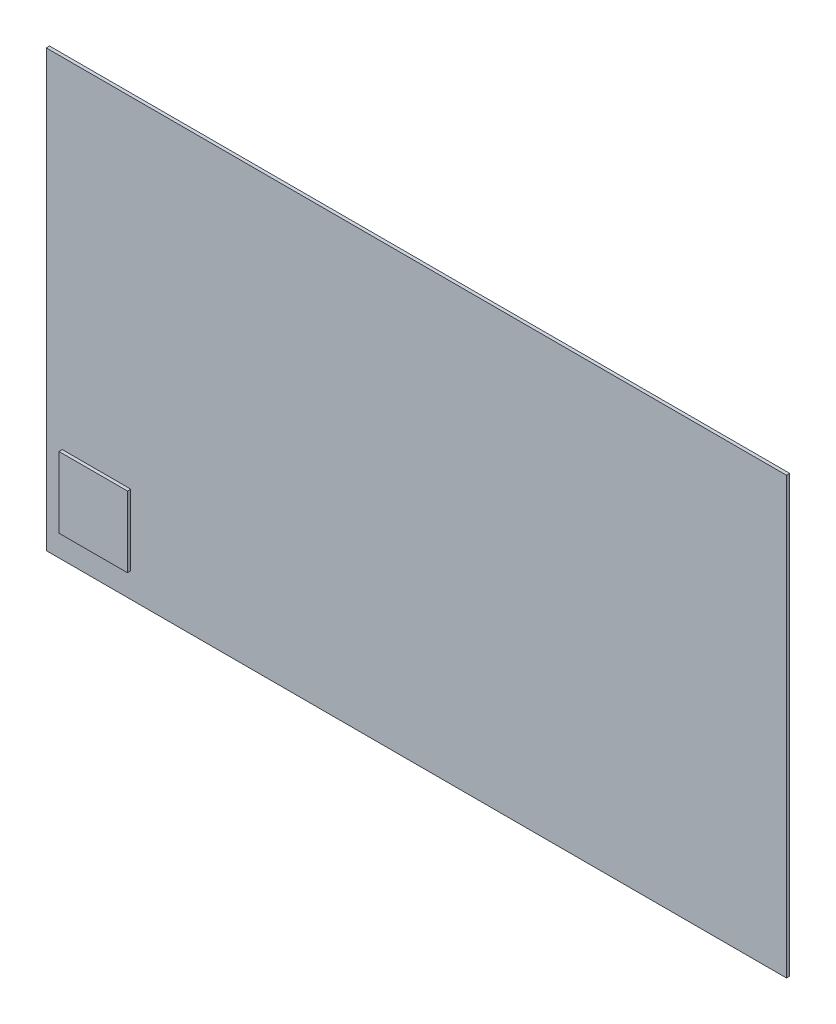
ISO-10303-21;
HEADER;
FILE_DESCRIPTION(('STEP AP214'),'2;1');
FILE_NAME('part.step','',(''),(''),'','','');
FILE_SCHEMA(('AUTOMOTIVE_DESIGN { 1 0 10303 214 1 1 1 1 }'));
ENDSEC;
DATA;
#1=APPLICATION_CONTEXT('core data for automotive mechanical design processes');
#2=APPLICATION_PROTOCOL_DEFINITION('international standard','automotive_design',2000,#1);
#3=PRODUCT_CONTEXT('',#1,'mechanical');
#4=PRODUCT('Part','Part','',(#3));
#5=PRODUCT_RELATED_PRODUCT_CATEGORY('part','',(#4));
#6=PRODUCT_DEFINITION_FORMATION('','',#4);
#7=PRODUCT_DEFINITION_CONTEXT('part definition',#1,'design');
#8=PRODUCT_DEFINITION('design','',#6,#7);
#9=PRODUCT_DEFINITION_SHAPE('','',#8);
#10=(LENGTH_UNIT() NAMED_UNIT(*) SI_UNIT(.MILLI.,.METRE.));
#11=(NAMED_UNIT(*) PLANE_ANGLE_UNIT() SI_UNIT($,.RADIAN.));
#12=(NAMED_UNIT(*) SI_UNIT($,.STERADIAN.) SOLID_ANGLE_UNIT());
#13=UNCERTAINTY_MEASURE_WITH_UNIT(LENGTH_MEASURE(1.E-05),#10,'distance_accuracy_value','');
#14=(GEOMETRIC_REPRESENTATION_CONTEXT(3) GLOBAL_UNCERTAINTY_ASSIGNED_CONTEXT((#13)) GLOBAL_UNIT_ASSIGNED_CONTEXT((#10,
#11,#12)) REPRESENTATION_CONTEXT('',''));
#15=CARTESIAN_POINT('',(0.,0.,0.));
#16=DIRECTION('',(0.,0.,1.));
#17=DIRECTION('',(1.,0.,0.));
#18=AXIS2_PLACEMENT_3D('',#15,#16,#17);
#19=CARTESIAN_POINT('',(0.,0.,0.381));
#20=DIRECTION('',(0.,0.,1.));
#21=DIRECTION('',(1.,0.,0.));
#22=AXIS2_PLACEMENT_3D('',#19,#20,#21);
#23=PLANE('',#22);
#24=DIRECTION('',(0.,1.,0.));
#25=VECTOR('',#24,1.);
#26=CARTESIAN_POINT('',(43.18,25.4,0.381));
#27=LINE('',#26,#25);
#28=CARTESIAN_POINT('',(43.18,-25.4,0.381));
#29=VERTEX_POINT('',#28);
#30=CARTESIAN_POINT('',(43.18,25.4,0.381));
#31=VERTEX_POINT('',#30);
#32=EDGE_CURVE('E140',#29,#31,#27,.T.);
#33=ORIENTED_EDGE('',*,*,#32,.T.);
#34=DIRECTION('',(-1.,0.,0.));
#35=VECTOR('',#34,1.);
#36=CARTESIAN_POINT('',(-43.18,25.4,0.381));
#37=LINE('',#36,#35);
#38=CARTESIAN_POINT('',(-43.18,25.4,0.381));
#39=VERTEX_POINT('',#38);
#40=EDGE_CURVE('E85',#31,#39,#37,.T.);
#41=ORIENTED_EDGE('',*,*,#40,.T.);
#42=DIRECTION('',(0.,-1.,0.));
#43=VECTOR('',#42,1.);
#44=CARTESIAN_POINT('',(-43.18,25.4,0.381));
#45=LINE('',#44,#43);
#46=CARTESIAN_POINT('',(-43.18,-25.4,0.381));
#47=VERTEX_POINT('',#46);
#48=EDGE_CURVE('E143',#39,#47,#45,.T.);
#49=ORIENTED_EDGE('',*,*,#48,.T.);
#50=DIRECTION('',(1.,0.,0.));
#51=VECTOR('',#50,1.);
#52=CARTESIAN_POINT('',(-43.18,-25.4,0.381));
#53=LINE('',#52,#51);
#54=EDGE_CURVE('E57',#47,#29,#53,.T.);
#55=ORIENTED_EDGE('',*,*,#54,.T.);
#56=EDGE_LOOP('',(#33,#41,#49,#55));
#57=FACE_BOUND('',#56,.T.);
#58=DIRECTION('',(-1.,0.,0.));
#59=VECTOR('',#58,1.);
#60=CARTESIAN_POINT('',(-41.318188726038,-14.2548154222372,0.381));
#61=LINE('',#60,#59);
#62=CARTESIAN_POINT('',(-33.3245849920017,-14.2548154222372,0.381));
#63=VERTEX_POINT('',#62);
#64=CARTESIAN_POINT('',(-41.318188726038,-14.2548154222372,0.381));
#65=VERTEX_POINT('',#64);
#66=EDGE_CURVE('E263',#63,#65,#61,.T.);
#67=ORIENTED_EDGE('',*,*,#66,.F.);
#68=DIRECTION('',(0.,1.,0.));
#69=VECTOR('',#68,1.);
#70=CARTESIAN_POINT('',(-33.3245849920017,-14.2548154222372,0.381));
#71=LINE('',#70,#69);
#72=CARTESIAN_POINT('',(-33.3245849920017,-22.5148726140748,0.381));
#73=VERTEX_POINT('',#72);
#74=EDGE_CURVE('E130',#73,#63,#71,.T.);
#75=ORIENTED_EDGE('',*,*,#74,.F.);
#76=DIRECTION('',(1.,0.,0.));
#77=VECTOR('',#76,1.);
#78=CARTESIAN_POINT('',(-41.318188726038,-22.5148726140748,0.381));
#79=LINE('',#78,#77);
#80=CARTESIAN_POINT('',(-41.318188726038,-22.5148726140748,0.381));
#81=VERTEX_POINT('',#80);
#82=EDGE_CURVE('E126',#81,#73,#79,.T.);
#83=ORIENTED_EDGE('',*,*,#82,.F.);
#84=DIRECTION('',(0.,-1.,0.));
#85=VECTOR('',#84,1.);
#86=CARTESIAN_POINT('',(-41.318188726038,-14.2548154222372,0.381));
#87=LINE('',#86,#85);
#88=EDGE_CURVE('E260',#65,#81,#87,.T.);
#89=ORIENTED_EDGE('',*,*,#88,.F.);
#90=EDGE_LOOP('',(#67,#75,#83,#89));
#91=FACE_BOUND('',#90,.T.);
#92=ADVANCED_FACE('F33',(#57,#91),#23,.T.);
#93=CARTESIAN_POINT('',(43.18,25.4,0.381));
#94=DIRECTION('',(-1.,0.,0.));
#95=DIRECTION('',(0.,-1.,0.));
#96=AXIS2_PLACEMENT_3D('',#93,#94,#95);
#97=PLANE('',#96);
#98=DIRECTION('',(0.,1.,0.));
#99=VECTOR('',#98,1.);
#100=CARTESIAN_POINT('',(43.18,25.4,0.));
#101=LINE('',#100,#99);
#102=CARTESIAN_POINT('',(43.18,-25.4,0.));
#103=VERTEX_POINT('',#102);
#104=CARTESIAN_POINT('',(43.18,25.4,0.));
#105=VERTEX_POINT('',#104);
#106=EDGE_CURVE('E132',#103,#105,#101,.T.);
#107=ORIENTED_EDGE('',*,*,#106,.T.);
#108=DIRECTION('',(0.,0.,-1.));
#109=VECTOR('',#108,1.);
#110=CARTESIAN_POINT('',(43.18,25.4,0.381));
#111=LINE('',#110,#109);
#112=EDGE_CURVE('E11',#31,#105,#111,.T.);
#113=ORIENTED_EDGE('',*,*,#112,.F.);
#114=ORIENTED_EDGE('',*,*,#32,.F.);
#115=DIRECTION('',(0.,0.,-1.));
#116=VECTOR('',#115,1.);
#117=CARTESIAN_POINT('',(43.18,-25.4,0.381));
#118=LINE('',#117,#116);
#119=EDGE_CURVE('E145',#29,#103,#118,.T.);
#120=ORIENTED_EDGE('',*,*,#119,.T.);
#121=EDGE_LOOP('',(#107,#113,#114,#120));
#122=FACE_BOUND('',#121,.T.);
#123=ADVANCED_FACE('F35',(#122),#97,.F.);
#124=CARTESIAN_POINT('',(-43.18,25.4,0.381));
#125=DIRECTION('',(0.,-1.,0.));
#126=DIRECTION('',(0.,0.,-1.));
#127=AXIS2_PLACEMENT_3D('',#124,#125,#126);
#128=PLANE('',#127);
#129=DIRECTION('',(-1.,0.,0.));
#130=VECTOR('',#129,1.);
#131=CARTESIAN_POINT('',(-43.18,25.4,0.));
#132=LINE('',#131,#130);
#133=CARTESIAN_POINT('',(-43.18,25.4,0.));
#134=VERTEX_POINT('',#133);
#135=EDGE_CURVE('E135',#105,#134,#132,.T.);
#136=ORIENTED_EDGE('',*,*,#135,.T.);
#137=DIRECTION('',(0.,0.,-1.));
#138=VECTOR('',#137,1.);
#139=CARTESIAN_POINT('',(-43.18,25.4,0.381));
#140=LINE('',#139,#138);
#141=EDGE_CURVE('E41',#39,#134,#140,.T.);
#142=ORIENTED_EDGE('',*,*,#141,.F.);
#143=ORIENTED_EDGE('',*,*,#40,.F.);
#144=ORIENTED_EDGE('',*,*,#112,.T.);
#145=EDGE_LOOP('',(#136,#142,#143,#144));
#146=FACE_BOUND('',#145,.T.);
#147=ADVANCED_FACE('F173',(#146),#128,.F.);
#148=CARTESIAN_POINT('',(-43.18,25.4,0.381));
#149=DIRECTION('',(1.,0.,0.));
#150=DIRECTION('',(0.,1.,0.));
#151=AXIS2_PLACEMENT_3D('',#148,#149,#150);
#152=PLANE('',#151);
#153=DIRECTION('',(0.,-1.,0.));
#154=VECTOR('',#153,1.);
#155=CARTESIAN_POINT('',(-43.18,25.4,0.));
#156=LINE('',#155,#154);
#157=CARTESIAN_POINT('',(-43.18,-25.4,0.));
#158=VERTEX_POINT('',#157);
#159=EDGE_CURVE('E148',#134,#158,#156,.T.);
#160=ORIENTED_EDGE('',*,*,#159,.T.);
#161=DIRECTION('',(0.,0.,-1.));
#162=VECTOR('',#161,1.);
#163=CARTESIAN_POINT('',(-43.18,-25.4,0.381));
#164=LINE('',#163,#162);
#165=EDGE_CURVE('E152',#47,#158,#164,.T.);
#166=ORIENTED_EDGE('',*,*,#165,.F.);
#167=ORIENTED_EDGE('',*,*,#48,.F.);
#168=ORIENTED_EDGE('',*,*,#141,.T.);
#169=EDGE_LOOP('',(#160,#166,#167,#168));
#170=FACE_BOUND('',#169,.T.);
#171=ADVANCED_FACE('F157',(#170),#152,.F.);
#172=CARTESIAN_POINT('',(-43.18,-25.4,0.381));
#173=DIRECTION('',(0.,1.,0.));
#174=DIRECTION('',(0.,0.,1.));
#175=AXIS2_PLACEMENT_3D('',#172,#173,#174);
#176=PLANE('',#175);
#177=DIRECTION('',(1.,0.,0.));
#178=VECTOR('',#177,1.);
#179=CARTESIAN_POINT('',(-43.18,-25.4,0.));
#180=LINE('',#179,#178);
#181=EDGE_CURVE('E78',#158,#103,#180,.T.);
#182=ORIENTED_EDGE('',*,*,#181,.T.);
#183=ORIENTED_EDGE('',*,*,#119,.F.);
#184=ORIENTED_EDGE('',*,*,#54,.F.);
#185=ORIENTED_EDGE('',*,*,#165,.T.);
#186=EDGE_LOOP('',(#182,#183,#184,#185));
#187=FACE_BOUND('',#186,.T.);
#188=ADVANCED_FACE('F165',(#187),#176,.F.);
#189=CARTESIAN_POINT('',(0.,0.,0.));
#190=DIRECTION('',(0.,0.,1.));
#191=DIRECTION('',(1.,0.,0.));
#192=AXIS2_PLACEMENT_3D('',#189,#190,#191);
#193=PLANE('',#192);
#194=ORIENTED_EDGE('',*,*,#106,.F.);
#195=ORIENTED_EDGE('',*,*,#181,.F.);
#196=ORIENTED_EDGE('',*,*,#159,.F.);
#197=ORIENTED_EDGE('',*,*,#135,.F.);
#198=EDGE_LOOP('',(#194,#195,#196,#197));
#199=FACE_BOUND('',#198,.T.);
#200=ADVANCED_FACE('F161',(#199),#193,.F.);
#201=CARTESIAN_POINT('',(-33.3245849920017,-14.2548154222372,0.762));
#202=DIRECTION('',(-1.,0.,0.));
#203=DIRECTION('',(0.,0.,1.));
#204=AXIS2_PLACEMENT_3D('',#201,#202,#203);
#205=PLANE('',#204);
#206=ORIENTED_EDGE('',*,*,#74,.T.);
#207=DIRECTION('',(0.,0.,-1.));
#208=VECTOR('',#207,1.);
#209=CARTESIAN_POINT('',(-33.3245849920017,-14.2548154222372,0.762));
#210=LINE('',#209,#208);
#211=CARTESIAN_POINT('',(-33.3245849920017,-14.2548154222372,0.762));
#212=VERTEX_POINT('',#211);
#213=EDGE_CURVE('E111',#212,#63,#210,.T.);
#214=ORIENTED_EDGE('',*,*,#213,.F.);
#215=DIRECTION('',(0.,1.,0.));
#216=VECTOR('',#215,1.);
#217=CARTESIAN_POINT('',(-33.3245849920017,-14.2548154222372,0.762));
#218=LINE('',#217,#216);
#219=CARTESIAN_POINT('',(-33.3245849920017,-22.5148726140748,0.762));
#220=VERTEX_POINT('',#219);
#221=EDGE_CURVE('E118',#220,#212,#218,.T.);
#222=ORIENTED_EDGE('',*,*,#221,.F.);
#223=DIRECTION('',(0.,0.,-1.));
#224=VECTOR('',#223,1.);
#225=CARTESIAN_POINT('',(-33.3245849920017,-22.5148726140748,0.762));
#226=LINE('',#225,#224);
#227=EDGE_CURVE('E258',#220,#73,#226,.T.);
#228=ORIENTED_EDGE('',*,*,#227,.T.);
#229=EDGE_LOOP('',(#206,#214,#222,#228));
#230=FACE_BOUND('',#229,.T.);
#231=ADVANCED_FACE('F128',(#230),#205,.F.);
#232=CARTESIAN_POINT('',(-41.318188726038,-14.2548154222372,0.762));
#233=DIRECTION('',(0.,-1.,0.));
#234=DIRECTION('',(0.,0.,-1.));
#235=AXIS2_PLACEMENT_3D('',#232,#233,#234);
#236=PLANE('',#235);
#237=ORIENTED_EDGE('',*,*,#66,.T.);
#238=DIRECTION('',(0.,0.,-1.));
#239=VECTOR('',#238,1.);
#240=CARTESIAN_POINT('',(-41.318188726038,-14.2548154222372,0.762));
#241=LINE('',#240,#239);
#242=CARTESIAN_POINT('',(-41.318188726038,-14.2548154222372,0.762));
#243=VERTEX_POINT('',#242);
#244=EDGE_CURVE('E114',#243,#65,#241,.T.);
#245=ORIENTED_EDGE('',*,*,#244,.F.);
#246=DIRECTION('',(-1.,0.,0.));
#247=VECTOR('',#246,1.);
#248=CARTESIAN_POINT('',(-41.318188726038,-14.2548154222372,0.762));
#249=LINE('',#248,#247);
#250=EDGE_CURVE('E107',#212,#243,#249,.T.);
#251=ORIENTED_EDGE('',*,*,#250,.F.);
#252=ORIENTED_EDGE('',*,*,#213,.T.);
#253=EDGE_LOOP('',(#237,#245,#251,#252));
#254=FACE_BOUND('',#253,.T.);
#255=ADVANCED_FACE('F109',(#254),#236,.F.);
#256=CARTESIAN_POINT('',(-41.318188726038,-14.2548154222372,0.762));
#257=DIRECTION('',(1.,0.,0.));
#258=DIRECTION('',(0.,0.,-1.));
#259=AXIS2_PLACEMENT_3D('',#256,#257,#258);
#260=PLANE('',#259);
#261=ORIENTED_EDGE('',*,*,#88,.T.);
#262=DIRECTION('',(0.,0.,-1.));
#263=VECTOR('',#262,1.);
#264=CARTESIAN_POINT('',(-41.318188726038,-22.5148726140748,0.762));
#265=LINE('',#264,#263);
#266=CARTESIAN_POINT('',(-41.318188726038,-22.5148726140748,0.762));
#267=VERTEX_POINT('',#266);
#268=EDGE_CURVE('E48',#267,#81,#265,.T.);
#269=ORIENTED_EDGE('',*,*,#268,.F.);
#270=DIRECTION('',(0.,-1.,0.));
#271=VECTOR('',#270,1.);
#272=CARTESIAN_POINT('',(-41.318188726038,-14.2548154222372,0.762));
#273=LINE('',#272,#271);
#274=EDGE_CURVE('E117',#243,#267,#273,.T.);
#275=ORIENTED_EDGE('',*,*,#274,.F.);
#276=ORIENTED_EDGE('',*,*,#244,.T.);
#277=EDGE_LOOP('',(#261,#269,#275,#276));
#278=FACE_BOUND('',#277,.T.);
#279=ADVANCED_FACE('F188',(#278),#260,.F.);
#280=CARTESIAN_POINT('',(-41.318188726038,-22.5148726140748,0.762));
#281=DIRECTION('',(0.,1.,0.));
#282=DIRECTION('',(0.,0.,1.));
#283=AXIS2_PLACEMENT_3D('',#280,#281,#282);
#284=PLANE('',#283);
#285=ORIENTED_EDGE('',*,*,#82,.T.);
#286=ORIENTED_EDGE('',*,*,#227,.F.);
#287=DIRECTION('',(1.,0.,0.));
#288=VECTOR('',#287,1.);
#289=CARTESIAN_POINT('',(-41.318188726038,-22.5148726140748,0.762));
#290=LINE('',#289,#288);
#291=EDGE_CURVE('E122',#267,#220,#290,.T.);
#292=ORIENTED_EDGE('',*,*,#291,.F.);
#293=ORIENTED_EDGE('',*,*,#268,.T.);
#294=EDGE_LOOP('',(#285,#286,#292,#293));
#295=FACE_BOUND('',#294,.T.);
#296=ADVANCED_FACE('F191',(#295),#284,.F.);
#297=CARTESIAN_POINT('',(0.,0.,0.762));
#298=DIRECTION('',(0.,0.,1.));
#299=DIRECTION('',(1.,0.,0.));
#300=AXIS2_PLACEMENT_3D('',#297,#298,#299);
#301=PLANE('',#300);
#302=ORIENTED_EDGE('',*,*,#221,.T.);
#303=ORIENTED_EDGE('',*,*,#250,.T.);
#304=ORIENTED_EDGE('',*,*,#274,.T.);
#305=ORIENTED_EDGE('',*,*,#291,.T.);
#306=EDGE_LOOP('',(#302,#303,#304,#305));
#307=FACE_BOUND('',#306,.T.);
#308=ADVANCED_FACE('F121',(#307),#301,.T.);
#309=CLOSED_SHELL('',(#92,#123,#147,#171,#188,#200,#231,#255,#279,#296,#308));
#310=MANIFOLD_SOLID_BREP('B2',#309);
#311=ADVANCED_BREP_SHAPE_REPRESENTATION('',(#18,#310),#14);
#312=SHAPE_DEFINITION_REPRESENTATION(#9,#311);
ENDSEC;
END-ISO-10303-21;
